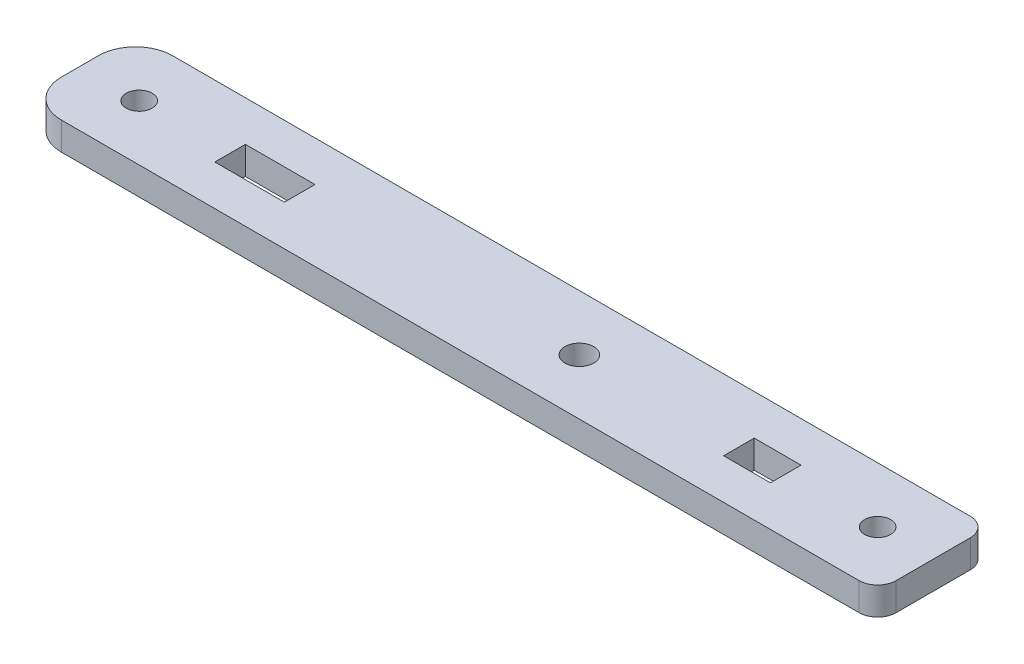
ISO-10303-21;
HEADER;
FILE_DESCRIPTION(('STEP AP214'),'2;1');
FILE_NAME('part.step','',(''),(''),'','','');
FILE_SCHEMA(('AUTOMOTIVE_DESIGN { 1 0 10303 214 1 1 1 1 }'));
ENDSEC;
DATA;
#1=APPLICATION_CONTEXT('core data for automotive mechanical design processes');
#2=APPLICATION_PROTOCOL_DEFINITION('international standard','automotive_design',2000,#1);
#3=PRODUCT_CONTEXT('',#1,'mechanical');
#4=PRODUCT('Part','Part','',(#3));
#5=PRODUCT_RELATED_PRODUCT_CATEGORY('part','',(#4));
#6=PRODUCT_DEFINITION_FORMATION('','',#4);
#7=PRODUCT_DEFINITION_CONTEXT('part definition',#1,'design');
#8=PRODUCT_DEFINITION('design','',#6,#7);
#9=PRODUCT_DEFINITION_SHAPE('','',#8);
#10=(LENGTH_UNIT() NAMED_UNIT(*) SI_UNIT(.MILLI.,.METRE.));
#11=(NAMED_UNIT(*) PLANE_ANGLE_UNIT() SI_UNIT($,.RADIAN.));
#12=(NAMED_UNIT(*) SI_UNIT($,.STERADIAN.) SOLID_ANGLE_UNIT());
#13=UNCERTAINTY_MEASURE_WITH_UNIT(LENGTH_MEASURE(1.E-05),#10,'distance_accuracy_value','');
#14=(GEOMETRIC_REPRESENTATION_CONTEXT(3) GLOBAL_UNCERTAINTY_ASSIGNED_CONTEXT((#13)) GLOBAL_UNIT_ASSIGNED_CONTEXT((#10,
#11,#12)) REPRESENTATION_CONTEXT('',''));
#15=CARTESIAN_POINT('',(0.,0.,0.));
#16=DIRECTION('',(0.,0.,1.));
#17=DIRECTION('',(1.,0.,0.));
#18=AXIS2_PLACEMENT_3D('',#15,#16,#17);
#19=CARTESIAN_POINT('',(0.,3.,0.));
#20=DIRECTION('',(1.,0.,0.));
#21=DIRECTION('',(0.,0.,-1.));
#22=AXIS2_PLACEMENT_3D('',#19,#20,#21);
#23=PLANE('',#22);
#24=DIRECTION('',(0.,0.,1.));
#25=VECTOR('',#24,1.);
#26=CARTESIAN_POINT('',(0.,3.,0.));
#27=LINE('',#26,#25);
#28=CARTESIAN_POINT('',(0.,3.,-8.));
#29=VERTEX_POINT('',#28);
#30=CARTESIAN_POINT('',(0.,3.,-4.));
#31=VERTEX_POINT('',#30);
#32=EDGE_CURVE('E242',#29,#31,#27,.T.);
#33=ORIENTED_EDGE('',*,*,#32,.F.);
#34=DIRECTION('',(0.,-1.,0.));
#35=VECTOR('',#34,1.);
#36=CARTESIAN_POINT('',(0.,3.,-8.));
#37=LINE('',#36,#35);
#38=CARTESIAN_POINT('',(0.,0.,-8.));
#39=VERTEX_POINT('',#38);
#40=EDGE_CURVE('E261',#29,#39,#37,.T.);
#41=ORIENTED_EDGE('',*,*,#40,.T.);
#42=DIRECTION('',(0.,0.,1.));
#43=VECTOR('',#42,1.);
#44=CARTESIAN_POINT('',(0.,0.,0.));
#45=LINE('',#44,#43);
#46=CARTESIAN_POINT('',(0.,0.,-4.));
#47=VERTEX_POINT('',#46);
#48=EDGE_CURVE('E215',#39,#47,#45,.T.);
#49=ORIENTED_EDGE('',*,*,#48,.T.);
#50=DIRECTION('',(0.,-1.,0.));
#51=VECTOR('',#50,1.);
#52=CARTESIAN_POINT('',(0.,3.,-4.));
#53=LINE('',#52,#51);
#54=EDGE_CURVE('E252',#47,#31,#53,.F.);
#55=ORIENTED_EDGE('',*,*,#54,.T.);
#56=EDGE_LOOP('',(#33,#41,#49,#55));
#57=FACE_BOUND('',#56,.T.);
#58=ADVANCED_FACE('F33',(#57),#23,.F.);
#59=CARTESIAN_POINT('',(0.,3.,0.));
#60=DIRECTION('',(0.,0.,-1.));
#61=DIRECTION('',(-1.,0.,0.));
#62=AXIS2_PLACEMENT_3D('',#59,#60,#61);
#63=PLANE('',#62);
#64=DIRECTION('',(1.,0.,0.));
#65=VECTOR('',#64,1.);
#66=CARTESIAN_POINT('',(0.,0.,0.));
#67=LINE('',#66,#65);
#68=CARTESIAN_POINT('',(4.,0.,0.));
#69=VERTEX_POINT('',#68);
#70=CARTESIAN_POINT('',(90.,0.,0.));
#71=VERTEX_POINT('',#70);
#72=EDGE_CURVE('E255',#69,#71,#67,.T.);
#73=ORIENTED_EDGE('',*,*,#72,.T.);
#74=DIRECTION('',(0.,-1.,0.));
#75=VECTOR('',#74,1.);
#76=CARTESIAN_POINT('',(90.,3.,0.));
#77=LINE('',#76,#75);
#78=CARTESIAN_POINT('',(90.,3.,0.));
#79=VERTEX_POINT('',#78);
#80=EDGE_CURVE('E11',#71,#79,#77,.F.);
#81=ORIENTED_EDGE('',*,*,#80,.T.);
#82=DIRECTION('',(1.,0.,0.));
#83=VECTOR('',#82,1.);
#84=CARTESIAN_POINT('',(0.,3.,0.));
#85=LINE('',#84,#83);
#86=CARTESIAN_POINT('',(4.,3.,0.));
#87=VERTEX_POINT('',#86);
#88=EDGE_CURVE('E245',#87,#79,#85,.T.);
#89=ORIENTED_EDGE('',*,*,#88,.F.);
#90=DIRECTION('',(0.,-1.,0.));
#91=VECTOR('',#90,1.);
#92=CARTESIAN_POINT('',(4.,3.,0.));
#93=LINE('',#92,#91);
#94=EDGE_CURVE('E276',#87,#69,#93,.T.);
#95=ORIENTED_EDGE('',*,*,#94,.T.);
#96=EDGE_LOOP('',(#73,#81,#89,#95));
#97=FACE_BOUND('',#96,.T.);
#98=ADVANCED_FACE('F310',(#97),#63,.F.);
#99=CARTESIAN_POINT('',(92.,3.,0.));
#100=DIRECTION('',(-1.,0.,0.));
#101=DIRECTION('',(0.,0.,1.));
#102=AXIS2_PLACEMENT_3D('',#99,#100,#101);
#103=PLANE('',#102);
#104=DIRECTION('',(0.,0.,-1.));
#105=VECTOR('',#104,1.);
#106=CARTESIAN_POINT('',(92.,0.,0.));
#107=LINE('',#106,#105);
#108=CARTESIAN_POINT('',(92.,0.,-2.));
#109=VERTEX_POINT('',#108);
#110=CARTESIAN_POINT('',(92.,0.,-10.));
#111=VERTEX_POINT('',#110);
#112=EDGE_CURVE('E257',#109,#111,#107,.T.);
#113=ORIENTED_EDGE('',*,*,#112,.T.);
#114=DIRECTION('',(0.,-1.,0.));
#115=VECTOR('',#114,1.);
#116=CARTESIAN_POINT('',(92.,3.,-10.));
#117=LINE('',#116,#115);
#118=CARTESIAN_POINT('',(92.,3.,-10.));
#119=VERTEX_POINT('',#118);
#120=EDGE_CURVE('E54',#111,#119,#117,.F.);
#121=ORIENTED_EDGE('',*,*,#120,.T.);
#122=DIRECTION('',(0.,0.,-1.));
#123=VECTOR('',#122,1.);
#124=CARTESIAN_POINT('',(92.,3.,0.));
#125=LINE('',#124,#123);
#126=CARTESIAN_POINT('',(92.,3.,-2.));
#127=VERTEX_POINT('',#126);
#128=EDGE_CURVE('E248',#127,#119,#125,.T.);
#129=ORIENTED_EDGE('',*,*,#128,.F.);
#130=DIRECTION('',(0.,-1.,0.));
#131=VECTOR('',#130,1.);
#132=CARTESIAN_POINT('',(92.,3.,-2.));
#133=LINE('',#132,#131);
#134=EDGE_CURVE('E286',#127,#109,#133,.T.);
#135=ORIENTED_EDGE('',*,*,#134,.T.);
#136=EDGE_LOOP('',(#113,#121,#129,#135));
#137=FACE_BOUND('',#136,.T.);
#138=ADVANCED_FACE('F305',(#137),#103,.F.);
#139=CARTESIAN_POINT('',(0.,3.,-12.));
#140=DIRECTION('',(0.,0.,1.));
#141=DIRECTION('',(1.,0.,0.));
#142=AXIS2_PLACEMENT_3D('',#139,#140,#141);
#143=PLANE('',#142);
#144=DIRECTION('',(-1.,0.,0.));
#145=VECTOR('',#144,1.);
#146=CARTESIAN_POINT('',(0.,3.,-12.));
#147=LINE('',#146,#145);
#148=CARTESIAN_POINT('',(90.,3.,-12.));
#149=VERTEX_POINT('',#148);
#150=CARTESIAN_POINT('',(4.,3.,-12.));
#151=VERTEX_POINT('',#150);
#152=EDGE_CURVE('E250',#149,#151,#147,.T.);
#153=ORIENTED_EDGE('',*,*,#152,.F.);
#154=DIRECTION('',(0.,-1.,0.));
#155=VECTOR('',#154,1.);
#156=CARTESIAN_POINT('',(90.,3.,-12.));
#157=LINE('',#156,#155);
#158=CARTESIAN_POINT('',(90.,0.,-12.));
#159=VERTEX_POINT('',#158);
#160=EDGE_CURVE('E279',#149,#159,#157,.T.);
#161=ORIENTED_EDGE('',*,*,#160,.T.);
#162=DIRECTION('',(-1.,0.,0.));
#163=VECTOR('',#162,1.);
#164=CARTESIAN_POINT('',(0.,0.,-12.));
#165=LINE('',#164,#163);
#166=CARTESIAN_POINT('',(4.,0.,-12.));
#167=VERTEX_POINT('',#166);
#168=EDGE_CURVE('E246',#159,#167,#165,.T.);
#169=ORIENTED_EDGE('',*,*,#168,.T.);
#170=DIRECTION('',(0.,-1.,0.));
#171=VECTOR('',#170,1.);
#172=CARTESIAN_POINT('',(4.,3.,-12.));
#173=LINE('',#172,#171);
#174=EDGE_CURVE('E269',#167,#151,#173,.F.);
#175=ORIENTED_EDGE('',*,*,#174,.T.);
#176=EDGE_LOOP('',(#153,#161,#169,#175));
#177=FACE_BOUND('',#176,.T.);
#178=ADVANCED_FACE('F298',(#177),#143,.F.);
#179=CARTESIAN_POINT('',(0.,3.,0.));
#180=DIRECTION('',(0.,-1.,0.));
#181=DIRECTION('',(0.,0.,-1.));
#182=AXIS2_PLACEMENT_3D('',#179,#180,#181);
#183=PLANE('',#182);
#184=CARTESIAN_POINT('',(6.4,3.,-6.));
#185=DIRECTION('',(0.,1.,0.));
#186=DIRECTION('',(0.,0.,1.));
#187=AXIS2_PLACEMENT_3D('',#184,#185,#186);
#188=CIRCLE('',#187,1.4);
#189=CARTESIAN_POINT('',(6.4,3.,-4.6));
#190=VERTEX_POINT('',#189);
#191=EDGE_CURVE('E216',#190,#190,#188,.T.);
#192=ORIENTED_EDGE('',*,*,#191,.F.);
#193=EDGE_LOOP('',(#192));
#194=FACE_BOUND('',#193,.T.);
#195=DIRECTION('',(-1.,0.,0.));
#196=VECTOR('',#195,1.);
#197=CARTESIAN_POINT('',(76.1,3.,-7.65));
#198=LINE('',#197,#196);
#199=CARTESIAN_POINT('',(76.1,3.,-7.65));
#200=VERTEX_POINT('',#199);
#201=CARTESIAN_POINT('',(71.05,3.,-7.65));
#202=VERTEX_POINT('',#201);
#203=EDGE_CURVE('E178',#200,#202,#198,.T.);
#204=ORIENTED_EDGE('',*,*,#203,.F.);
#205=DIRECTION('',(0.,0.,-1.));
#206=VECTOR('',#205,1.);
#207=CARTESIAN_POINT('',(76.1,3.,-7.5));
#208=LINE('',#207,#206);
#209=CARTESIAN_POINT('',(76.1,3.,-4.35));
#210=VERTEX_POINT('',#209);
#211=EDGE_CURVE('E160',#210,#200,#208,.T.);
#212=ORIENTED_EDGE('',*,*,#211,.F.);
#213=DIRECTION('',(1.,0.,0.));
#214=VECTOR('',#213,1.);
#215=CARTESIAN_POINT('',(76.1,3.,-4.35));
#216=LINE('',#215,#214);
#217=CARTESIAN_POINT('',(71.05,3.,-4.35));
#218=VERTEX_POINT('',#217);
#219=EDGE_CURVE('E174',#218,#210,#216,.T.);
#220=ORIENTED_EDGE('',*,*,#219,.F.);
#221=DIRECTION('',(0.,0.,1.));
#222=VECTOR('',#221,1.);
#223=CARTESIAN_POINT('',(71.05,3.,-7.5));
#224=LINE('',#223,#222);
#225=EDGE_CURVE('E165',#202,#218,#224,.T.);
#226=ORIENTED_EDGE('',*,*,#225,.F.);
#227=EDGE_LOOP('',(#204,#212,#220,#226));
#228=FACE_BOUND('',#227,.T.);
#229=DIRECTION('',(1.,0.,0.));
#230=VECTOR('',#229,1.);
#231=CARTESIAN_POINT('',(16.2,3.,-4.34999999999999));
#232=LINE('',#231,#230);
#233=CARTESIAN_POINT('',(16.2,3.,-4.34999999999999));
#234=VERTEX_POINT('',#233);
#235=CARTESIAN_POINT('',(23.7,3.,-4.34999999999999));
#236=VERTEX_POINT('',#235);
#237=EDGE_CURVE('E184',#234,#236,#232,.T.);
#238=ORIENTED_EDGE('',*,*,#237,.F.);
#239=DIRECTION('',(0.,0.,1.));
#240=VECTOR('',#239,1.);
#241=CARTESIAN_POINT('',(16.2,3.,-7.5));
#242=LINE('',#241,#240);
#243=CARTESIAN_POINT('',(16.2,3.,-7.64999999999999));
#244=VERTEX_POINT('',#243);
#245=EDGE_CURVE('E226',#244,#234,#242,.T.);
#246=ORIENTED_EDGE('',*,*,#245,.F.);
#247=DIRECTION('',(-1.,0.,0.));
#248=VECTOR('',#247,1.);
#249=CARTESIAN_POINT('',(16.2,3.,-7.64999999999999));
#250=LINE('',#249,#248);
#251=CARTESIAN_POINT('',(23.7,3.,-7.64999999999999));
#252=VERTEX_POINT('',#251);
#253=EDGE_CURVE('E191',#252,#244,#250,.T.);
#254=ORIENTED_EDGE('',*,*,#253,.F.);
#255=DIRECTION('',(0.,0.,-1.));
#256=VECTOR('',#255,1.);
#257=CARTESIAN_POINT('',(23.7,3.,-7.5));
#258=LINE('',#257,#256);
#259=EDGE_CURVE('E223',#236,#252,#258,.T.);
#260=ORIENTED_EDGE('',*,*,#259,.F.);
#261=EDGE_LOOP('',(#238,#246,#254,#260));
#262=FACE_BOUND('',#261,.T.);
#263=CARTESIAN_POINT('',(86.,3.,-6.));
#264=DIRECTION('',(0.,1.,0.));
#265=DIRECTION('',(0.,0.,1.));
#266=AXIS2_PLACEMENT_3D('',#263,#264,#265);
#267=CIRCLE('',#266,1.4);
#268=CARTESIAN_POINT('',(86.,3.,-4.6));
#269=VERTEX_POINT('',#268);
#270=EDGE_CURVE('E225',#269,#269,#267,.T.);
#271=ORIENTED_EDGE('',*,*,#270,.F.);
#272=EDGE_LOOP('',(#271));
#273=FACE_BOUND('',#272,.T.);
#274=CARTESIAN_POINT('',(53.85,3.,-6.));
#275=DIRECTION('',(0.,1.,0.));
#276=DIRECTION('',(0.,0.,1.));
#277=AXIS2_PLACEMENT_3D('',#274,#275,#276);
#278=CIRCLE('',#277,1.55);
#279=CARTESIAN_POINT('',(53.85,3.,-4.45));
#280=VERTEX_POINT('',#279);
#281=EDGE_CURVE('E234',#280,#280,#278,.T.);
#282=ORIENTED_EDGE('',*,*,#281,.F.);
#283=EDGE_LOOP('',(#282));
#284=FACE_BOUND('',#283,.T.);
#285=ORIENTED_EDGE('',*,*,#128,.T.);
#286=CARTESIAN_POINT('',(90.,3.,-10.));
#287=DIRECTION('',(0.,-1.,0.));
#288=DIRECTION('',(0.,0.,-1.));
#289=AXIS2_PLACEMENT_3D('',#286,#287,#288);
#290=CIRCLE('',#289,2.);
#291=EDGE_CURVE('E41',#119,#149,#290,.F.);
#292=ORIENTED_EDGE('',*,*,#291,.T.);
#293=ORIENTED_EDGE('',*,*,#152,.T.);
#294=CARTESIAN_POINT('',(4.,3.,-8.));
#295=DIRECTION('',(0.,-1.,0.));
#296=DIRECTION('',(0.,0.,-1.));
#297=AXIS2_PLACEMENT_3D('',#294,#295,#296);
#298=CIRCLE('',#297,4.);
#299=EDGE_CURVE('E274',#151,#29,#298,.F.);
#300=ORIENTED_EDGE('',*,*,#299,.T.);
#301=ORIENTED_EDGE('',*,*,#32,.T.);
#302=CARTESIAN_POINT('',(4.,3.,-4.));
#303=DIRECTION('',(0.,-1.,0.));
#304=DIRECTION('',(0.,0.,-1.));
#305=AXIS2_PLACEMENT_3D('',#302,#303,#304);
#306=CIRCLE('',#305,4.);
#307=EDGE_CURVE('E272',#31,#87,#306,.F.);
#308=ORIENTED_EDGE('',*,*,#307,.T.);
#309=ORIENTED_EDGE('',*,*,#88,.T.);
#310=CARTESIAN_POINT('',(90.,3.,-2.));
#311=DIRECTION('',(0.,-1.,0.));
#312=DIRECTION('',(0.,0.,-1.));
#313=AXIS2_PLACEMENT_3D('',#310,#311,#312);
#314=CIRCLE('',#313,2.);
#315=EDGE_CURVE('E290',#79,#127,#314,.F.);
#316=ORIENTED_EDGE('',*,*,#315,.T.);
#317=EDGE_LOOP('',(#285,#292,#293,#300,#301,#308,#309,#316));
#318=FACE_BOUND('',#317,.T.);
#319=ADVANCED_FACE('F294',(#194,#228,#262,#273,#284,#318),#183,.F.);
#320=CARTESIAN_POINT('',(0.,0.,0.));
#321=DIRECTION('',(0.,-1.,0.));
#322=DIRECTION('',(0.,0.,-1.));
#323=AXIS2_PLACEMENT_3D('',#320,#321,#322);
#324=PLANE('',#323);
#325=DIRECTION('',(0.,0.,1.));
#326=VECTOR('',#325,1.);
#327=CARTESIAN_POINT('',(16.2,0.,-7.5));
#328=LINE('',#327,#326);
#329=CARTESIAN_POINT('',(16.2,0.,-7.64999999999999));
#330=VERTEX_POINT('',#329);
#331=CARTESIAN_POINT('',(16.2,0.,-4.34999999999999));
#332=VERTEX_POINT('',#331);
#333=EDGE_CURVE('E220',#330,#332,#328,.T.);
#334=ORIENTED_EDGE('',*,*,#333,.T.);
#335=DIRECTION('',(1.,0.,0.));
#336=VECTOR('',#335,1.);
#337=CARTESIAN_POINT('',(16.2,0.,-4.34999999999999));
#338=LINE('',#337,#336);
#339=CARTESIAN_POINT('',(23.7,0.,-4.34999999999999));
#340=VERTEX_POINT('',#339);
#341=EDGE_CURVE('E180',#332,#340,#338,.T.);
#342=ORIENTED_EDGE('',*,*,#341,.T.);
#343=DIRECTION('',(0.,0.,-1.));
#344=VECTOR('',#343,1.);
#345=CARTESIAN_POINT('',(23.7,0.,-7.5));
#346=LINE('',#345,#344);
#347=CARTESIAN_POINT('',(23.7,0.,-7.64999999999999));
#348=VERTEX_POINT('',#347);
#349=EDGE_CURVE('E222',#340,#348,#346,.T.);
#350=ORIENTED_EDGE('',*,*,#349,.T.);
#351=DIRECTION('',(-1.,0.,0.));
#352=VECTOR('',#351,1.);
#353=CARTESIAN_POINT('',(16.2,0.,-7.64999999999999));
#354=LINE('',#353,#352);
#355=EDGE_CURVE('E201',#348,#330,#354,.T.);
#356=ORIENTED_EDGE('',*,*,#355,.T.);
#357=EDGE_LOOP('',(#334,#342,#350,#356));
#358=FACE_BOUND('',#357,.T.);
#359=DIRECTION('',(0.,0.,-1.));
#360=VECTOR('',#359,1.);
#361=CARTESIAN_POINT('',(76.1,0.,-7.5));
#362=LINE('',#361,#360);
#363=CARTESIAN_POINT('',(76.1,0.,-4.35));
#364=VERTEX_POINT('',#363);
#365=CARTESIAN_POINT('',(76.1,0.,-7.65));
#366=VERTEX_POINT('',#365);
#367=EDGE_CURVE('E159',#364,#366,#362,.T.);
#368=ORIENTED_EDGE('',*,*,#367,.T.);
#369=DIRECTION('',(-1.,0.,0.));
#370=VECTOR('',#369,1.);
#371=CARTESIAN_POINT('',(76.1,0.,-7.65));
#372=LINE('',#371,#370);
#373=CARTESIAN_POINT('',(71.05,0.,-7.65));
#374=VERTEX_POINT('',#373);
#375=EDGE_CURVE('E155',#366,#374,#372,.T.);
#376=ORIENTED_EDGE('',*,*,#375,.T.);
#377=DIRECTION('',(0.,0.,1.));
#378=VECTOR('',#377,1.);
#379=CARTESIAN_POINT('',(71.05,0.,-7.5));
#380=LINE('',#379,#378);
#381=CARTESIAN_POINT('',(71.05,0.,-4.35));
#382=VERTEX_POINT('',#381);
#383=EDGE_CURVE('E148',#374,#382,#380,.T.);
#384=ORIENTED_EDGE('',*,*,#383,.T.);
#385=DIRECTION('',(1.,0.,0.));
#386=VECTOR('',#385,1.);
#387=CARTESIAN_POINT('',(76.1,0.,-4.35));
#388=LINE('',#387,#386);
#389=EDGE_CURVE('E153',#382,#364,#388,.T.);
#390=ORIENTED_EDGE('',*,*,#389,.T.);
#391=EDGE_LOOP('',(#368,#376,#384,#390));
#392=FACE_BOUND('',#391,.T.);
#393=CARTESIAN_POINT('',(6.4,0.,-6.));
#394=DIRECTION('',(0.,1.,0.));
#395=DIRECTION('',(0.,0.,1.));
#396=AXIS2_PLACEMENT_3D('',#393,#394,#395);
#397=CIRCLE('',#396,1.4);
#398=CARTESIAN_POINT('',(6.4,0.,-4.6));
#399=VERTEX_POINT('',#398);
#400=EDGE_CURVE('E212',#399,#399,#397,.T.);
#401=ORIENTED_EDGE('',*,*,#400,.T.);
#402=EDGE_LOOP('',(#401));
#403=FACE_BOUND('',#402,.T.);
#404=CARTESIAN_POINT('',(86.,0.,-6.));
#405=DIRECTION('',(0.,1.,0.));
#406=DIRECTION('',(0.,0.,1.));
#407=AXIS2_PLACEMENT_3D('',#404,#405,#406);
#408=CIRCLE('',#407,1.4);
#409=CARTESIAN_POINT('',(86.,0.,-4.6));
#410=VERTEX_POINT('',#409);
#411=EDGE_CURVE('E237',#410,#410,#408,.T.);
#412=ORIENTED_EDGE('',*,*,#411,.T.);
#413=EDGE_LOOP('',(#412));
#414=FACE_BOUND('',#413,.T.);
#415=CARTESIAN_POINT('',(53.85,0.,-6.));
#416=DIRECTION('',(0.,1.,0.));
#417=DIRECTION('',(0.,0.,1.));
#418=AXIS2_PLACEMENT_3D('',#415,#416,#417);
#419=CIRCLE('',#418,1.55);
#420=CARTESIAN_POINT('',(53.85,0.,-4.45));
#421=VERTEX_POINT('',#420);
#422=EDGE_CURVE('E219',#421,#421,#419,.T.);
#423=ORIENTED_EDGE('',*,*,#422,.T.);
#424=EDGE_LOOP('',(#423));
#425=FACE_BOUND('',#424,.T.);
#426=ORIENTED_EDGE('',*,*,#168,.F.);
#427=CARTESIAN_POINT('',(90.,0.,-10.));
#428=DIRECTION('',(0.,-1.,0.));
#429=DIRECTION('',(0.,0.,-1.));
#430=AXIS2_PLACEMENT_3D('',#427,#428,#429);
#431=CIRCLE('',#430,2.);
#432=EDGE_CURVE('E284',#159,#111,#431,.T.);
#433=ORIENTED_EDGE('',*,*,#432,.T.);
#434=ORIENTED_EDGE('',*,*,#112,.F.);
#435=CARTESIAN_POINT('',(90.,0.,-2.));
#436=DIRECTION('',(0.,-1.,0.));
#437=DIRECTION('',(0.,0.,-1.));
#438=AXIS2_PLACEMENT_3D('',#435,#436,#437);
#439=CIRCLE('',#438,2.);
#440=EDGE_CURVE('E282',#109,#71,#439,.T.);
#441=ORIENTED_EDGE('',*,*,#440,.T.);
#442=ORIENTED_EDGE('',*,*,#72,.F.);
#443=CARTESIAN_POINT('',(4.,0.,-4.));
#444=DIRECTION('',(0.,-1.,0.));
#445=DIRECTION('',(0.,0.,-1.));
#446=AXIS2_PLACEMENT_3D('',#443,#444,#445);
#447=CIRCLE('',#446,4.);
#448=EDGE_CURVE('E264',#69,#47,#447,.T.);
#449=ORIENTED_EDGE('',*,*,#448,.T.);
#450=ORIENTED_EDGE('',*,*,#48,.F.);
#451=CARTESIAN_POINT('',(4.,0.,-8.));
#452=DIRECTION('',(0.,-1.,0.));
#453=DIRECTION('',(0.,0.,-1.));
#454=AXIS2_PLACEMENT_3D('',#451,#452,#453);
#455=CIRCLE('',#454,4.);
#456=EDGE_CURVE('E266',#39,#167,#455,.T.);
#457=ORIENTED_EDGE('',*,*,#456,.T.);
#458=EDGE_LOOP('',(#426,#433,#434,#441,#442,#449,#450,#457));
#459=FACE_BOUND('',#458,.T.);
#460=ADVANCED_FACE('F150',(#358,#392,#403,#414,#425,#459),#324,.T.);
#461=CARTESIAN_POINT('',(4.,3.,-8.));
#462=DIRECTION('',(0.,-1.,0.));
#463=DIRECTION('',(0.,0.,-1.));
#464=AXIS2_PLACEMENT_3D('',#461,#462,#463);
#465=CYLINDRICAL_SURFACE('',#464,4.);
#466=ORIENTED_EDGE('',*,*,#299,.F.);
#467=ORIENTED_EDGE('',*,*,#174,.F.);
#468=ORIENTED_EDGE('',*,*,#456,.F.);
#469=ORIENTED_EDGE('',*,*,#40,.F.);
#470=EDGE_LOOP('',(#466,#467,#468,#469));
#471=FACE_BOUND('',#470,.T.);
#472=ADVANCED_FACE('F321',(#471),#465,.T.);
#473=CARTESIAN_POINT('',(4.,3.,-4.));
#474=DIRECTION('',(0.,-1.,0.));
#475=DIRECTION('',(0.,0.,-1.));
#476=AXIS2_PLACEMENT_3D('',#473,#474,#475);
#477=CYLINDRICAL_SURFACE('',#476,4.);
#478=ORIENTED_EDGE('',*,*,#307,.F.);
#479=ORIENTED_EDGE('',*,*,#54,.F.);
#480=ORIENTED_EDGE('',*,*,#448,.F.);
#481=ORIENTED_EDGE('',*,*,#94,.F.);
#482=EDGE_LOOP('',(#478,#479,#480,#481));
#483=FACE_BOUND('',#482,.T.);
#484=ADVANCED_FACE('F314',(#483),#477,.T.);
#485=CARTESIAN_POINT('',(90.,3.,-10.));
#486=DIRECTION('',(0.,-1.,0.));
#487=DIRECTION('',(0.,0.,-1.));
#488=AXIS2_PLACEMENT_3D('',#485,#486,#487);
#489=CYLINDRICAL_SURFACE('',#488,2.);
#490=ORIENTED_EDGE('',*,*,#291,.F.);
#491=ORIENTED_EDGE('',*,*,#120,.F.);
#492=ORIENTED_EDGE('',*,*,#432,.F.);
#493=ORIENTED_EDGE('',*,*,#160,.F.);
#494=EDGE_LOOP('',(#490,#491,#492,#493));
#495=FACE_BOUND('',#494,.T.);
#496=ADVANCED_FACE('F302',(#495),#489,.T.);
#497=CARTESIAN_POINT('',(90.,3.,-2.));
#498=DIRECTION('',(0.,-1.,0.));
#499=DIRECTION('',(0.,0.,-1.));
#500=AXIS2_PLACEMENT_3D('',#497,#498,#499);
#501=CYLINDRICAL_SURFACE('',#500,2.);
#502=ORIENTED_EDGE('',*,*,#315,.F.);
#503=ORIENTED_EDGE('',*,*,#80,.F.);
#504=ORIENTED_EDGE('',*,*,#440,.F.);
#505=ORIENTED_EDGE('',*,*,#134,.F.);
#506=EDGE_LOOP('',(#502,#503,#504,#505));
#507=FACE_BOUND('',#506,.T.);
#508=ADVANCED_FACE('F35',(#507),#501,.T.);
#509=CARTESIAN_POINT('',(53.85,0.,-6.));
#510=DIRECTION('',(0.,1.,0.));
#511=DIRECTION('',(0.,0.,1.));
#512=AXIS2_PLACEMENT_3D('',#509,#510,#511);
#513=CYLINDRICAL_SURFACE('',#512,1.55);
#514=ORIENTED_EDGE('',*,*,#422,.F.);
#515=EDGE_LOOP('',(#514));
#516=FACE_BOUND('',#515,.T.);
#517=ORIENTED_EDGE('',*,*,#281,.T.);
#518=EDGE_LOOP('',(#517));
#519=FACE_BOUND('',#518,.T.);
#520=ADVANCED_FACE('F349',(#516,#519),#513,.F.);
#521=CARTESIAN_POINT('',(86.,0.,-6.));
#522=DIRECTION('',(0.,1.,0.));
#523=DIRECTION('',(0.,0.,1.));
#524=AXIS2_PLACEMENT_3D('',#521,#522,#523);
#525=CYLINDRICAL_SURFACE('',#524,1.4);
#526=ORIENTED_EDGE('',*,*,#411,.F.);
#527=EDGE_LOOP('',(#526));
#528=FACE_BOUND('',#527,.T.);
#529=ORIENTED_EDGE('',*,*,#270,.T.);
#530=EDGE_LOOP('',(#529));
#531=FACE_BOUND('',#530,.T.);
#532=ADVANCED_FACE('F345',(#528,#531),#525,.F.);
#533=CARTESIAN_POINT('',(16.2,0.,-7.5));
#534=DIRECTION('',(-1.,0.,0.));
#535=DIRECTION('',(0.,0.,1.));
#536=AXIS2_PLACEMENT_3D('',#533,#534,#535);
#537=PLANE('',#536);
#538=ORIENTED_EDGE('',*,*,#245,.T.);
#539=DIRECTION('',(0.,1.,0.));
#540=VECTOR('',#539,1.);
#541=CARTESIAN_POINT('',(16.2,0.,-4.34999999999999));
#542=LINE('',#541,#540);
#543=EDGE_CURVE('E183',#332,#234,#542,.T.);
#544=ORIENTED_EDGE('',*,*,#543,.F.);
#545=ORIENTED_EDGE('',*,*,#333,.F.);
#546=DIRECTION('',(0.,1.,0.));
#547=VECTOR('',#546,1.);
#548=CARTESIAN_POINT('',(16.2,0.,-7.64999999999999));
#549=LINE('',#548,#547);
#550=EDGE_CURVE('E207',#330,#244,#549,.T.);
#551=ORIENTED_EDGE('',*,*,#550,.T.);
#552=EDGE_LOOP('',(#538,#544,#545,#551));
#553=FACE_BOUND('',#552,.T.);
#554=ADVANCED_FACE('F348',(#553),#537,.F.);
#555=CARTESIAN_POINT('',(23.7,0.,-7.5));
#556=DIRECTION('',(1.,0.,0.));
#557=DIRECTION('',(0.,0.,-1.));
#558=AXIS2_PLACEMENT_3D('',#555,#556,#557);
#559=PLANE('',#558);
#560=ORIENTED_EDGE('',*,*,#259,.T.);
#561=DIRECTION('',(0.,1.,0.));
#562=VECTOR('',#561,1.);
#563=CARTESIAN_POINT('',(23.7,0.,-7.64999999999999));
#564=LINE('',#563,#562);
#565=EDGE_CURVE('E204',#348,#252,#564,.T.);
#566=ORIENTED_EDGE('',*,*,#565,.F.);
#567=ORIENTED_EDGE('',*,*,#349,.F.);
#568=DIRECTION('',(0.,1.,0.));
#569=VECTOR('',#568,1.);
#570=CARTESIAN_POINT('',(23.7,0.,-4.34999999999999));
#571=LINE('',#570,#569);
#572=EDGE_CURVE('E188',#340,#236,#571,.T.);
#573=ORIENTED_EDGE('',*,*,#572,.T.);
#574=EDGE_LOOP('',(#560,#566,#567,#573));
#575=FACE_BOUND('',#574,.T.);
#576=ADVANCED_FACE('F357',(#575),#559,.F.);
#577=CARTESIAN_POINT('',(71.05,0.,-7.5));
#578=DIRECTION('',(-1.,0.,0.));
#579=DIRECTION('',(0.,0.,1.));
#580=AXIS2_PLACEMENT_3D('',#577,#578,#579);
#581=PLANE('',#580);
#582=ORIENTED_EDGE('',*,*,#225,.T.);
#583=DIRECTION('',(0.,1.,0.));
#584=VECTOR('',#583,1.);
#585=CARTESIAN_POINT('',(71.05,0.,-4.35));
#586=LINE('',#585,#584);
#587=EDGE_CURVE('E163',#382,#218,#586,.T.);
#588=ORIENTED_EDGE('',*,*,#587,.F.);
#589=ORIENTED_EDGE('',*,*,#383,.F.);
#590=DIRECTION('',(0.,1.,0.));
#591=VECTOR('',#590,1.);
#592=CARTESIAN_POINT('',(71.05,0.,-7.65));
#593=LINE('',#592,#591);
#594=EDGE_CURVE('E187',#374,#202,#593,.T.);
#595=ORIENTED_EDGE('',*,*,#594,.T.);
#596=EDGE_LOOP('',(#582,#588,#589,#595));
#597=FACE_BOUND('',#596,.T.);
#598=ADVANCED_FACE('F164',(#597),#581,.F.);
#599=CARTESIAN_POINT('',(76.1,0.,-7.5));
#600=DIRECTION('',(1.,0.,0.));
#601=DIRECTION('',(0.,0.,-1.));
#602=AXIS2_PLACEMENT_3D('',#599,#600,#601);
#603=PLANE('',#602);
#604=ORIENTED_EDGE('',*,*,#211,.T.);
#605=DIRECTION('',(0.,1.,0.));
#606=VECTOR('',#605,1.);
#607=CARTESIAN_POINT('',(76.1,0.,-7.65));
#608=LINE('',#607,#606);
#609=EDGE_CURVE('E195',#366,#200,#608,.T.);
#610=ORIENTED_EDGE('',*,*,#609,.F.);
#611=ORIENTED_EDGE('',*,*,#367,.F.);
#612=DIRECTION('',(0.,1.,0.));
#613=VECTOR('',#612,1.);
#614=CARTESIAN_POINT('',(76.1,0.,-4.35));
#615=LINE('',#614,#613);
#616=EDGE_CURVE('E169',#364,#210,#615,.T.);
#617=ORIENTED_EDGE('',*,*,#616,.T.);
#618=EDGE_LOOP('',(#604,#610,#611,#617));
#619=FACE_BOUND('',#618,.T.);
#620=ADVANCED_FACE('F356',(#619),#603,.F.);
#621=CARTESIAN_POINT('',(6.4,0.,-6.));
#622=DIRECTION('',(0.,1.,0.));
#623=DIRECTION('',(0.,0.,1.));
#624=AXIS2_PLACEMENT_3D('',#621,#622,#623);
#625=CYLINDRICAL_SURFACE('',#624,1.4);
#626=ORIENTED_EDGE('',*,*,#400,.F.);
#627=EDGE_LOOP('',(#626));
#628=FACE_BOUND('',#627,.T.);
#629=ORIENTED_EDGE('',*,*,#191,.T.);
#630=EDGE_LOOP('',(#629));
#631=FACE_BOUND('',#630,.T.);
#632=ADVANCED_FACE('F360',(#628,#631),#625,.F.);
#633=CARTESIAN_POINT('',(76.1,0.,-4.35));
#634=DIRECTION('',(0.,0.,1.));
#635=DIRECTION('',(1.,0.,0.));
#636=AXIS2_PLACEMENT_3D('',#633,#634,#635);
#637=PLANE('',#636);
#638=ORIENTED_EDGE('',*,*,#219,.T.);
#639=ORIENTED_EDGE('',*,*,#616,.F.);
#640=ORIENTED_EDGE('',*,*,#389,.F.);
#641=ORIENTED_EDGE('',*,*,#587,.T.);
#642=EDGE_LOOP('',(#638,#639,#640,#641));
#643=FACE_BOUND('',#642,.T.);
#644=ADVANCED_FACE('F172',(#643),#637,.F.);
#645=CARTESIAN_POINT('',(76.1,0.,-7.65));
#646=DIRECTION('',(0.,0.,-1.));
#647=DIRECTION('',(-1.,0.,0.));
#648=AXIS2_PLACEMENT_3D('',#645,#646,#647);
#649=PLANE('',#648);
#650=ORIENTED_EDGE('',*,*,#203,.T.);
#651=ORIENTED_EDGE('',*,*,#594,.F.);
#652=ORIENTED_EDGE('',*,*,#375,.F.);
#653=ORIENTED_EDGE('',*,*,#609,.T.);
#654=EDGE_LOOP('',(#650,#651,#652,#653));
#655=FACE_BOUND('',#654,.T.);
#656=ADVANCED_FACE('F376',(#655),#649,.F.);
#657=CARTESIAN_POINT('',(16.2,0.,-4.34999999999999));
#658=DIRECTION('',(0.,0.,1.));
#659=DIRECTION('',(1.,0.,0.));
#660=AXIS2_PLACEMENT_3D('',#657,#658,#659);
#661=PLANE('',#660);
#662=ORIENTED_EDGE('',*,*,#237,.T.);
#663=ORIENTED_EDGE('',*,*,#572,.F.);
#664=ORIENTED_EDGE('',*,*,#341,.F.);
#665=ORIENTED_EDGE('',*,*,#543,.T.);
#666=EDGE_LOOP('',(#662,#663,#664,#665));
#667=FACE_BOUND('',#666,.T.);
#668=ADVANCED_FACE('F374',(#667),#661,.F.);
#669=CARTESIAN_POINT('',(16.2,0.,-7.64999999999999));
#670=DIRECTION('',(0.,0.,-1.));
#671=DIRECTION('',(-1.,0.,0.));
#672=AXIS2_PLACEMENT_3D('',#669,#670,#671);
#673=PLANE('',#672);
#674=ORIENTED_EDGE('',*,*,#253,.T.);
#675=ORIENTED_EDGE('',*,*,#550,.F.);
#676=ORIENTED_EDGE('',*,*,#355,.F.);
#677=ORIENTED_EDGE('',*,*,#565,.T.);
#678=EDGE_LOOP('',(#674,#675,#676,#677));
#679=FACE_BOUND('',#678,.T.);
#680=ADVANCED_FACE('F371',(#679),#673,.F.);
#681=CLOSED_SHELL('',(#58,#98,#138,#178,#319,#460,#472,#484,#496,#508,#520,#532,#554,#576,#598,
#620,#632,#644,#656,#668,#680));
#682=MANIFOLD_SOLID_BREP('B2',#681);
#683=ADVANCED_BREP_SHAPE_REPRESENTATION('',(#18,#682),#14);
#684=SHAPE_DEFINITION_REPRESENTATION(#9,#683);
ENDSEC;
END-ISO-10303-21;
